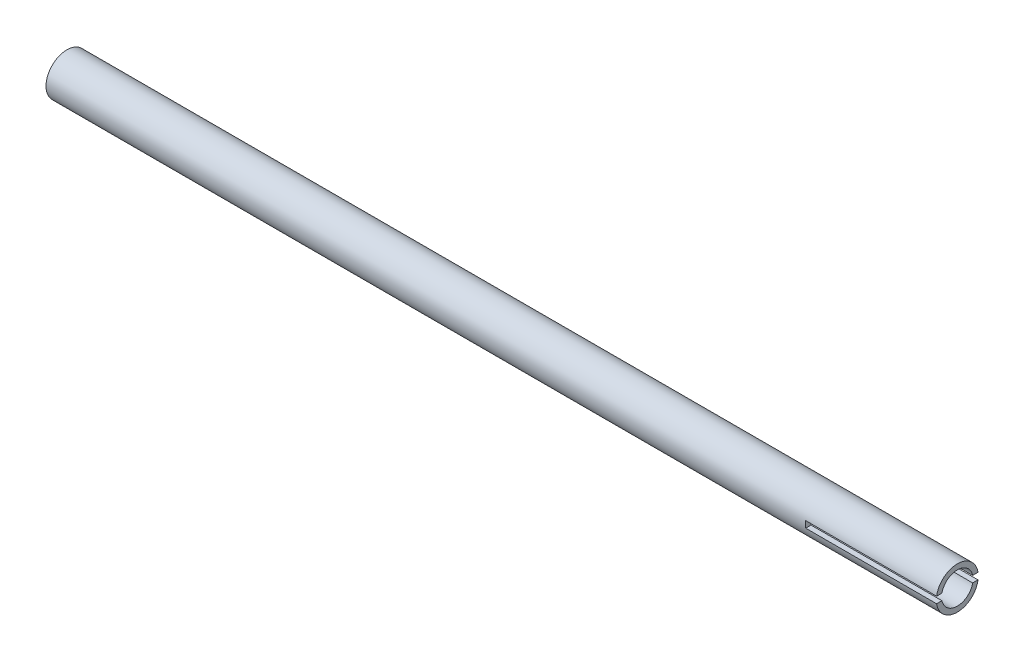
ISO-10303-21;
HEADER;
FILE_DESCRIPTION(('STEP AP214'),'2;1');
FILE_NAME('part.step','',(''),(''),'','','');
FILE_SCHEMA(('AUTOMOTIVE_DESIGN { 1 0 10303 214 1 1 1 1 }'));
ENDSEC;
DATA;
#1=APPLICATION_CONTEXT('core data for automotive mechanical design processes');
#2=APPLICATION_PROTOCOL_DEFINITION('international standard','automotive_design',2000,#1);
#3=PRODUCT_CONTEXT('',#1,'mechanical');
#4=PRODUCT('Part','Part','',(#3));
#5=PRODUCT_RELATED_PRODUCT_CATEGORY('part','',(#4));
#6=PRODUCT_DEFINITION_FORMATION('','',#4);
#7=PRODUCT_DEFINITION_CONTEXT('part definition',#1,'design');
#8=PRODUCT_DEFINITION('design','',#6,#7);
#9=PRODUCT_DEFINITION_SHAPE('','',#8);
#10=(LENGTH_UNIT() NAMED_UNIT(*) SI_UNIT(.MILLI.,.METRE.));
#11=(NAMED_UNIT(*) PLANE_ANGLE_UNIT() SI_UNIT($,.RADIAN.));
#12=(NAMED_UNIT(*) SI_UNIT($,.STERADIAN.) SOLID_ANGLE_UNIT());
#13=UNCERTAINTY_MEASURE_WITH_UNIT(LENGTH_MEASURE(1.E-05),#10,'distance_accuracy_value','');
#14=(GEOMETRIC_REPRESENTATION_CONTEXT(3) GLOBAL_UNCERTAINTY_ASSIGNED_CONTEXT((#13)) GLOBAL_UNIT_ASSIGNED_CONTEXT((#10,
#11,#12)) REPRESENTATION_CONTEXT('',''));
#15=CARTESIAN_POINT('',(0.,0.,0.));
#16=DIRECTION('',(0.,0.,1.));
#17=DIRECTION('',(1.,0.,0.));
#18=AXIS2_PLACEMENT_3D('',#15,#16,#17);
#19=CARTESIAN_POINT('',(170.,0.,0.));
#20=DIRECTION('',(1.,0.,0.));
#21=DIRECTION('',(0.,0.,-1.));
#22=AXIS2_PLACEMENT_3D('',#19,#20,#21);
#23=PLANE('',#22);
#24=DIRECTION('',(0.,0.,1.));
#25=VECTOR('',#24,1.);
#26=CARTESIAN_POINT('',(170.,-1.25,-8.));
#27=LINE('',#26,#25);
#28=CARTESIAN_POINT('',(170.,-1.25,5.86834729715275));
#29=VERTEX_POINT('',#28);
#30=CARTESIAN_POINT('',(170.,-1.25,7.90174031463955));
#31=VERTEX_POINT('',#30);
#32=EDGE_CURVE('E179',#29,#31,#27,.T.);
#33=ORIENTED_EDGE('',*,*,#32,.T.);
#34=CARTESIAN_POINT('',(170.,0.,0.));
#35=DIRECTION('',(1.,0.,0.));
#36=DIRECTION('',(0.,0.,-1.));
#37=AXIS2_PLACEMENT_3D('',#34,#35,#36);
#38=CIRCLE('',#37,8.);
#39=CARTESIAN_POINT('',(170.,-1.25,-7.90174031463955));
#40=VERTEX_POINT('',#39);
#41=EDGE_CURVE('E156',#31,#40,#38,.T.);
#42=ORIENTED_EDGE('',*,*,#41,.T.);
#43=CARTESIAN_POINT('',(170.,-1.25,-5.86834729715275));
#44=VERTEX_POINT('',#43);
#45=EDGE_CURVE('E136',#40,#44,#27,.T.);
#46=ORIENTED_EDGE('',*,*,#45,.T.);
#47=CARTESIAN_POINT('',(170.,0.,0.));
#48=DIRECTION('',(1.,0.,0.));
#49=DIRECTION('',(0.,0.,-1.));
#50=AXIS2_PLACEMENT_3D('',#47,#48,#49);
#51=CIRCLE('',#50,6.);
#52=EDGE_CURVE('E152',#29,#44,#51,.T.);
#53=ORIENTED_EDGE('',*,*,#52,.F.);
#54=EDGE_LOOP('',(#33,#42,#46,#53));
#55=FACE_BOUND('',#54,.T.);
#56=ADVANCED_FACE('F39',(#55),#23,.T.);
#57=DIRECTION('',(0.,0.,1.));
#58=VECTOR('',#57,1.);
#59=CARTESIAN_POINT('',(170.,1.25,-8.));
#60=LINE('',#59,#58);
#61=CARTESIAN_POINT('',(170.,1.25,-7.90174031463955));
#62=VERTEX_POINT('',#61);
#63=CARTESIAN_POINT('',(170.,1.25,-5.86834729715275));
#64=VERTEX_POINT('',#63);
#65=EDGE_CURVE('E63',#62,#64,#60,.T.);
#66=ORIENTED_EDGE('',*,*,#65,.F.);
#67=CARTESIAN_POINT('',(170.,1.25,7.90174031463955));
#68=VERTEX_POINT('',#67);
#69=EDGE_CURVE('E130',#62,#68,#38,.T.);
#70=ORIENTED_EDGE('',*,*,#69,.T.);
#71=CARTESIAN_POINT('',(170.,1.25,5.86834729715275));
#72=VERTEX_POINT('',#71);
#73=EDGE_CURVE('E195',#72,#68,#60,.T.);
#74=ORIENTED_EDGE('',*,*,#73,.F.);
#75=EDGE_CURVE('E147',#64,#72,#51,.T.);
#76=ORIENTED_EDGE('',*,*,#75,.F.);
#77=EDGE_LOOP('',(#66,#70,#74,#76));
#78=FACE_BOUND('',#77,.T.);
#79=ADVANCED_FACE('F193',(#78),#23,.T.);
#80=CARTESIAN_POINT('',(-170.,0.,0.));
#81=DIRECTION('',(1.,0.,0.));
#82=DIRECTION('',(0.,0.,-1.));
#83=AXIS2_PLACEMENT_3D('',#80,#81,#82);
#84=PLANE('',#83);
#85=CARTESIAN_POINT('',(-170.,0.,0.));
#86=DIRECTION('',(1.,0.,0.));
#87=DIRECTION('',(0.,0.,-1.));
#88=AXIS2_PLACEMENT_3D('',#85,#86,#87);
#89=CIRCLE('',#88,8.);
#90=CARTESIAN_POINT('',(-170.,0.,-8.));
#91=VERTEX_POINT('',#90);
#92=EDGE_CURVE('E151',#91,#91,#89,.T.);
#93=ORIENTED_EDGE('',*,*,#92,.F.);
#94=EDGE_LOOP('',(#93));
#95=FACE_BOUND('',#94,.T.);
#96=CARTESIAN_POINT('',(-170.,0.,0.));
#97=DIRECTION('',(1.,0.,0.));
#98=DIRECTION('',(0.,0.,-1.));
#99=AXIS2_PLACEMENT_3D('',#96,#97,#98);
#100=CIRCLE('',#99,6.);
#101=CARTESIAN_POINT('',(-170.,0.,-6.));
#102=VERTEX_POINT('',#101);
#103=EDGE_CURVE('E146',#102,#102,#100,.T.);
#104=ORIENTED_EDGE('',*,*,#103,.T.);
#105=EDGE_LOOP('',(#104));
#106=FACE_BOUND('',#105,.T.);
#107=ADVANCED_FACE('F226',(#95,#106),#84,.F.);
#108=CARTESIAN_POINT('',(170.,0.,0.));
#109=DIRECTION('',(-1.,0.,0.));
#110=DIRECTION('',(0.,0.,1.));
#111=AXIS2_PLACEMENT_3D('',#108,#109,#110);
#112=CYLINDRICAL_SURFACE('',#111,8.);
#113=DIRECTION('',(-1.,0.,0.));
#114=VECTOR('',#113,1.);
#115=CARTESIAN_POINT('',(170.,1.25,-7.90174031463955));
#116=LINE('',#115,#114);
#117=CARTESIAN_POINT('',(120.,1.24999999999999,-7.90174031463955));
#118=VERTEX_POINT('',#117);
#119=EDGE_CURVE('E121',#62,#118,#116,.T.);
#120=ORIENTED_EDGE('',*,*,#119,.T.);
#121=CARTESIAN_POINT('',(120.,0.,0.));
#122=DIRECTION('',(-1.,0.,0.));
#123=DIRECTION('',(0.,0.,1.));
#124=AXIS2_PLACEMENT_3D('',#121,#122,#123);
#125=CIRCLE('',#124,8.);
#126=CARTESIAN_POINT('',(120.,-1.25000000000001,-7.90174031463955));
#127=VERTEX_POINT('',#126);
#128=EDGE_CURVE('E105',#118,#127,#125,.T.);
#129=ORIENTED_EDGE('',*,*,#128,.T.);
#130=DIRECTION('',(-1.,0.,0.));
#131=VECTOR('',#130,1.);
#132=CARTESIAN_POINT('',(170.,-1.25,-7.90174031463955));
#133=LINE('',#132,#131);
#134=EDGE_CURVE('E117',#127,#40,#133,.F.);
#135=ORIENTED_EDGE('',*,*,#134,.T.);
#136=ORIENTED_EDGE('',*,*,#41,.F.);
#137=DIRECTION('',(-1.,0.,0.));
#138=VECTOR('',#137,1.);
#139=CARTESIAN_POINT('',(170.,-1.25,7.90174031463955));
#140=LINE('',#139,#138);
#141=CARTESIAN_POINT('',(120.,-1.25000000000001,7.90174031463955));
#142=VERTEX_POINT('',#141);
#143=EDGE_CURVE('E142',#31,#142,#140,.T.);
#144=ORIENTED_EDGE('',*,*,#143,.T.);
#145=CARTESIAN_POINT('',(120.,1.24999999999999,7.90174031463955));
#146=VERTEX_POINT('',#145);
#147=EDGE_CURVE('E118',#142,#146,#125,.T.);
#148=ORIENTED_EDGE('',*,*,#147,.T.);
#149=DIRECTION('',(-1.,0.,0.));
#150=VECTOR('',#149,1.);
#151=CARTESIAN_POINT('',(170.,1.25,7.90174031463955));
#152=LINE('',#151,#150);
#153=EDGE_CURVE('E132',#146,#68,#152,.F.);
#154=ORIENTED_EDGE('',*,*,#153,.T.);
#155=ORIENTED_EDGE('',*,*,#69,.F.);
#156=EDGE_LOOP('',(#120,#129,#135,#136,#144,#148,#154,#155));
#157=FACE_BOUND('',#156,.T.);
#158=ORIENTED_EDGE('',*,*,#92,.T.);
#159=EDGE_LOOP('',(#158));
#160=FACE_BOUND('',#159,.T.);
#161=ADVANCED_FACE('F41',(#157,#160),#112,.T.);
#162=CARTESIAN_POINT('',(170.,0.,0.));
#163=DIRECTION('',(-1.,0.,0.));
#164=DIRECTION('',(0.,0.,1.));
#165=AXIS2_PLACEMENT_3D('',#162,#163,#164);
#166=CYLINDRICAL_SURFACE('',#165,6.);
#167=DIRECTION('',(-1.,0.,0.));
#168=VECTOR('',#167,1.);
#169=CARTESIAN_POINT('',(170.,-1.25,-5.86834729715275));
#170=LINE('',#169,#168);
#171=CARTESIAN_POINT('',(120.,-1.25000000000001,-5.86834729715275));
#172=VERTEX_POINT('',#171);
#173=EDGE_CURVE('E11',#172,#44,#170,.F.);
#174=ORIENTED_EDGE('',*,*,#173,.F.);
#175=CARTESIAN_POINT('',(120.,0.,0.));
#176=DIRECTION('',(-1.,0.,0.));
#177=DIRECTION('',(0.,0.,1.));
#178=AXIS2_PLACEMENT_3D('',#175,#176,#177);
#179=CIRCLE('',#178,6.);
#180=CARTESIAN_POINT('',(120.,1.24999999999999,-5.86834729715275));
#181=VERTEX_POINT('',#180);
#182=EDGE_CURVE('E48',#181,#172,#179,.T.);
#183=ORIENTED_EDGE('',*,*,#182,.F.);
#184=DIRECTION('',(-1.,0.,0.));
#185=VECTOR('',#184,1.);
#186=CARTESIAN_POINT('',(170.,1.25,-5.86834729715275));
#187=LINE('',#186,#185);
#188=EDGE_CURVE('E122',#64,#181,#187,.T.);
#189=ORIENTED_EDGE('',*,*,#188,.F.);
#190=ORIENTED_EDGE('',*,*,#75,.T.);
#191=DIRECTION('',(-1.,0.,0.));
#192=VECTOR('',#191,1.);
#193=CARTESIAN_POINT('',(170.,1.25,5.86834729715275));
#194=LINE('',#193,#192);
#195=CARTESIAN_POINT('',(120.,1.25,5.86834729715275));
#196=VERTEX_POINT('',#195);
#197=EDGE_CURVE('E163',#196,#72,#194,.F.);
#198=ORIENTED_EDGE('',*,*,#197,.F.);
#199=CARTESIAN_POINT('',(120.,-1.25000000000001,5.86834729715275));
#200=VERTEX_POINT('',#199);
#201=EDGE_CURVE('E166',#200,#196,#179,.T.);
#202=ORIENTED_EDGE('',*,*,#201,.F.);
#203=DIRECTION('',(-1.,0.,0.));
#204=VECTOR('',#203,1.);
#205=CARTESIAN_POINT('',(170.,-1.25,5.86834729715275));
#206=LINE('',#205,#204);
#207=EDGE_CURVE('E169',#29,#200,#206,.T.);
#208=ORIENTED_EDGE('',*,*,#207,.F.);
#209=ORIENTED_EDGE('',*,*,#52,.T.);
#210=EDGE_LOOP('',(#174,#183,#189,#190,#198,#202,#208,#209));
#211=FACE_BOUND('',#210,.T.);
#212=ORIENTED_EDGE('',*,*,#103,.F.);
#213=EDGE_LOOP('',(#212));
#214=FACE_BOUND('',#213,.T.);
#215=ADVANCED_FACE('F182',(#211,#214),#166,.F.);
#216=CARTESIAN_POINT('',(170.,1.25,-8.));
#217=DIRECTION('',(0.,1.,0.));
#218=DIRECTION('',(-1.,0.,0.));
#219=AXIS2_PLACEMENT_3D('',#216,#217,#218);
#220=PLANE('',#219);
#221=DIRECTION('',(0.,0.,1.));
#222=VECTOR('',#221,1.);
#223=CARTESIAN_POINT('',(120.,1.24999999999999,-8.));
#224=LINE('',#223,#222);
#225=EDGE_CURVE('E55',#196,#146,#224,.T.);
#226=ORIENTED_EDGE('',*,*,#225,.F.);
#227=ORIENTED_EDGE('',*,*,#197,.T.);
#228=ORIENTED_EDGE('',*,*,#73,.T.);
#229=ORIENTED_EDGE('',*,*,#153,.F.);
#230=EDGE_LOOP('',(#226,#227,#228,#229));
#231=FACE_BOUND('',#230,.T.);
#232=ADVANCED_FACE('F211',(#231),#220,.F.);
#233=CARTESIAN_POINT('',(120.,1.24999999999999,-8.));
#234=DIRECTION('',(-1.,0.,0.));
#235=DIRECTION('',(0.,0.,1.));
#236=AXIS2_PLACEMENT_3D('',#233,#234,#235);
#237=PLANE('',#236);
#238=ORIENTED_EDGE('',*,*,#147,.F.);
#239=DIRECTION('',(0.,0.,1.));
#240=VECTOR('',#239,1.);
#241=CARTESIAN_POINT('',(120.,-1.25000000000001,-8.));
#242=LINE('',#241,#240);
#243=EDGE_CURVE('E124',#200,#142,#242,.T.);
#244=ORIENTED_EDGE('',*,*,#243,.F.);
#245=ORIENTED_EDGE('',*,*,#201,.T.);
#246=ORIENTED_EDGE('',*,*,#225,.T.);
#247=EDGE_LOOP('',(#238,#244,#245,#246));
#248=FACE_BOUND('',#247,.T.);
#249=ADVANCED_FACE('F209',(#248),#237,.F.);
#250=CARTESIAN_POINT('',(170.,-1.25,-8.));
#251=DIRECTION('',(0.,-1.,0.));
#252=DIRECTION('',(1.,0.,0.));
#253=AXIS2_PLACEMENT_3D('',#250,#251,#252);
#254=PLANE('',#253);
#255=ORIENTED_EDGE('',*,*,#32,.F.);
#256=ORIENTED_EDGE('',*,*,#207,.T.);
#257=ORIENTED_EDGE('',*,*,#243,.T.);
#258=ORIENTED_EDGE('',*,*,#143,.F.);
#259=EDGE_LOOP('',(#255,#256,#257,#258));
#260=FACE_BOUND('',#259,.T.);
#261=ADVANCED_FACE('F206',(#260),#254,.F.);
#262=EDGE_CURVE('E111',#127,#172,#242,.T.);
#263=ORIENTED_EDGE('',*,*,#262,.T.);
#264=ORIENTED_EDGE('',*,*,#173,.T.);
#265=ORIENTED_EDGE('',*,*,#45,.F.);
#266=ORIENTED_EDGE('',*,*,#134,.F.);
#267=EDGE_LOOP('',(#263,#264,#265,#266));
#268=FACE_BOUND('',#267,.T.);
#269=ADVANCED_FACE('F176',(#268),#254,.F.);
#270=EDGE_CURVE('E108',#118,#181,#224,.T.);
#271=ORIENTED_EDGE('',*,*,#270,.T.);
#272=ORIENTED_EDGE('',*,*,#182,.T.);
#273=ORIENTED_EDGE('',*,*,#262,.F.);
#274=ORIENTED_EDGE('',*,*,#128,.F.);
#275=EDGE_LOOP('',(#271,#272,#273,#274));
#276=FACE_BOUND('',#275,.T.);
#277=ADVANCED_FACE('F107',(#276),#237,.F.);
#278=ORIENTED_EDGE('',*,*,#65,.T.);
#279=ORIENTED_EDGE('',*,*,#188,.T.);
#280=ORIENTED_EDGE('',*,*,#270,.F.);
#281=ORIENTED_EDGE('',*,*,#119,.F.);
#282=EDGE_LOOP('',(#278,#279,#280,#281));
#283=FACE_BOUND('',#282,.T.);
#284=ADVANCED_FACE('F120',(#283),#220,.F.);
#285=CLOSED_SHELL('',(#56,#79,#107,#161,#215,#232,#249,#261,#269,#277,#284));
#286=MANIFOLD_SOLID_BREP('B2',#285);
#287=ADVANCED_BREP_SHAPE_REPRESENTATION('',(#18,#286),#14);
#288=SHAPE_DEFINITION_REPRESENTATION(#9,#287);
ENDSEC;
END-ISO-10303-21;
